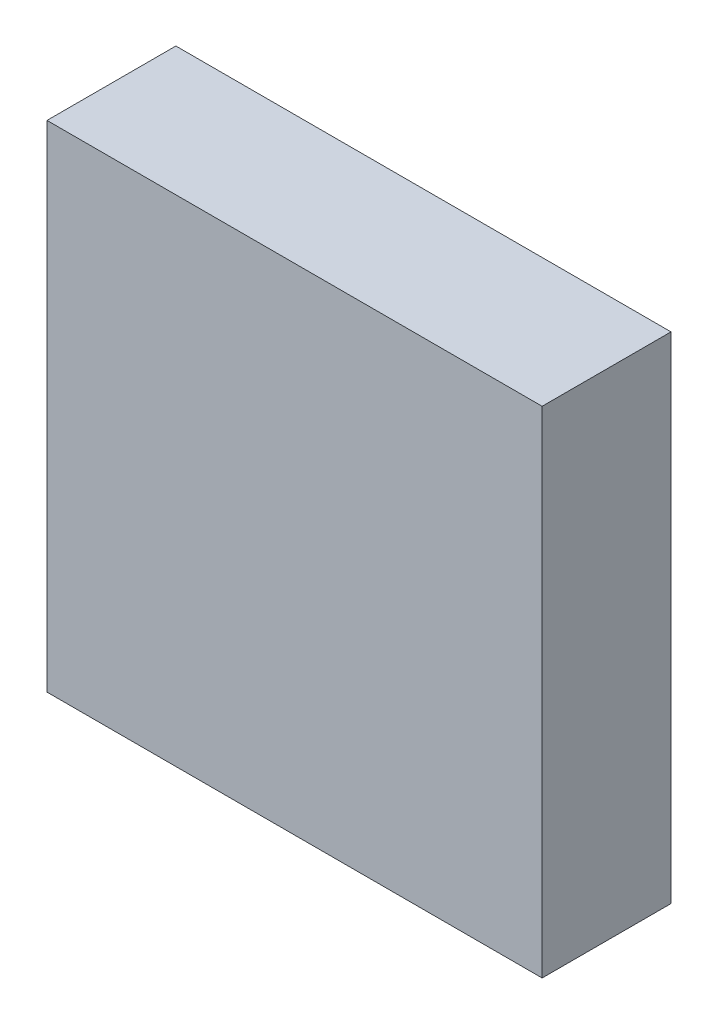
ISO-10303-21;
HEADER;
FILE_DESCRIPTION(('STEP AP214'),'2;1');
FILE_NAME('part.step','',(''),(''),'','','');
FILE_SCHEMA(('AUTOMOTIVE_DESIGN { 1 0 10303 214 1 1 1 1 }'));
ENDSEC;
DATA;
#1=APPLICATION_CONTEXT('core data for automotive mechanical design processes');
#2=APPLICATION_PROTOCOL_DEFINITION('international standard','automotive_design',2000,#1);
#3=PRODUCT_CONTEXT('',#1,'mechanical');
#4=PRODUCT('Part','Part','',(#3));
#5=PRODUCT_RELATED_PRODUCT_CATEGORY('part','',(#4));
#6=PRODUCT_DEFINITION_FORMATION('','',#4);
#7=PRODUCT_DEFINITION_CONTEXT('part definition',#1,'design');
#8=PRODUCT_DEFINITION('design','',#6,#7);
#9=PRODUCT_DEFINITION_SHAPE('','',#8);
#10=(LENGTH_UNIT() NAMED_UNIT(*) SI_UNIT(.MILLI.,.METRE.));
#11=(NAMED_UNIT(*) PLANE_ANGLE_UNIT() SI_UNIT($,.RADIAN.));
#12=(NAMED_UNIT(*) SI_UNIT($,.STERADIAN.) SOLID_ANGLE_UNIT());
#13=UNCERTAINTY_MEASURE_WITH_UNIT(LENGTH_MEASURE(1.E-05),#10,'distance_accuracy_value','');
#14=(GEOMETRIC_REPRESENTATION_CONTEXT(3) GLOBAL_UNCERTAINTY_ASSIGNED_CONTEXT((#13)) GLOBAL_UNIT_ASSIGNED_CONTEXT((#10,
#11,#12)) REPRESENTATION_CONTEXT('',''));
#15=CARTESIAN_POINT('',(0.,0.,0.));
#16=DIRECTION('',(0.,0.,1.));
#17=DIRECTION('',(1.,0.,0.));
#18=AXIS2_PLACEMENT_3D('',#15,#16,#17);
#19=CARTESIAN_POINT('',(-1.82500016,1.82500016,0.95000064));
#20=DIRECTION('',(0.,0.,1.));
#21=DIRECTION('',(1.,0.,0.));
#22=AXIS2_PLACEMENT_3D('',#19,#20,#21);
#23=PLANE('',#22);
#24=DIRECTION('',(0.,1.,0.));
#25=VECTOR('',#24,1.);
#26=CARTESIAN_POINT('',(1.82500016,1.82500016,0.95000064));
#27=LINE('',#26,#25);
#28=CARTESIAN_POINT('',(1.82500016,1.82500016,0.95000064));
#29=VERTEX_POINT('',#28);
#30=CARTESIAN_POINT('',(1.82500016,-1.82500016,0.95000064));
#31=VERTEX_POINT('',#30);
#32=EDGE_CURVE('E52',#29,#31,#27,.F.);
#33=ORIENTED_EDGE('',*,*,#32,.F.);
#34=DIRECTION('',(1.,0.,0.));
#35=VECTOR('',#34,1.);
#36=CARTESIAN_POINT('',(-1.82500016,1.82500016,0.95000064));
#37=LINE('',#36,#35);
#38=CARTESIAN_POINT('',(-1.82500016,1.82500016,0.95000064));
#39=VERTEX_POINT('',#38);
#40=EDGE_CURVE('E67',#39,#29,#37,.T.);
#41=ORIENTED_EDGE('',*,*,#40,.F.);
#42=DIRECTION('',(0.,1.,0.));
#43=VECTOR('',#42,1.);
#44=CARTESIAN_POINT('',(-1.82500016,-1.82500016,0.95000064));
#45=LINE('',#44,#43);
#46=CARTESIAN_POINT('',(-1.82500016,-1.82500016,0.95000064));
#47=VERTEX_POINT('',#46);
#48=EDGE_CURVE('E19',#47,#39,#45,.T.);
#49=ORIENTED_EDGE('',*,*,#48,.F.);
#50=DIRECTION('',(1.,0.,0.));
#51=VECTOR('',#50,1.);
#52=CARTESIAN_POINT('',(1.82500016,-1.82500016,0.95000064));
#53=LINE('',#52,#51);
#54=EDGE_CURVE('E57',#31,#47,#53,.F.);
#55=ORIENTED_EDGE('',*,*,#54,.F.);
#56=EDGE_LOOP('',(#33,#41,#49,#55));
#57=FACE_BOUND('',#56,.T.);
#58=ADVANCED_FACE('F16',(#57),#23,.T.);
#59=CARTESIAN_POINT('',(-1.82500016,-1.82500016,0.));
#60=DIRECTION('',(-1.,0.,0.));
#61=DIRECTION('',(0.,0.,1.));
#62=AXIS2_PLACEMENT_3D('',#59,#60,#61);
#63=PLANE('',#62);
#64=DIRECTION('',(0.,0.,1.));
#65=VECTOR('',#64,1.);
#66=CARTESIAN_POINT('',(-1.82500016,1.82500016,0.));
#67=LINE('',#66,#65);
#68=CARTESIAN_POINT('',(-1.82500016,1.82500016,0.));
#69=VERTEX_POINT('',#68);
#70=EDGE_CURVE('E78',#69,#39,#67,.T.);
#71=ORIENTED_EDGE('',*,*,#70,.F.);
#72=DIRECTION('',(0.,1.,0.));
#73=VECTOR('',#72,1.);
#74=CARTESIAN_POINT('',(-1.82500016,1.82500016,0.));
#75=LINE('',#74,#73);
#76=CARTESIAN_POINT('',(-1.82500016,-1.82500016,0.));
#77=VERTEX_POINT('',#76);
#78=EDGE_CURVE('E73',#69,#77,#75,.F.);
#79=ORIENTED_EDGE('',*,*,#78,.T.);
#80=DIRECTION('',(0.,0.,-1.));
#81=VECTOR('',#80,1.);
#82=CARTESIAN_POINT('',(-1.82500016,-1.82500016,0.));
#83=LINE('',#82,#81);
#84=EDGE_CURVE('E62',#47,#77,#83,.T.);
#85=ORIENTED_EDGE('',*,*,#84,.F.);
#86=ORIENTED_EDGE('',*,*,#48,.T.);
#87=EDGE_LOOP('',(#71,#79,#85,#86));
#88=FACE_BOUND('',#87,.T.);
#89=ADVANCED_FACE('F72',(#88),#63,.T.);
#90=CARTESIAN_POINT('',(1.82500016,-1.82500016,0.));
#91=DIRECTION('',(0.,-1.,0.));
#92=DIRECTION('',(0.,0.,-1.));
#93=AXIS2_PLACEMENT_3D('',#90,#91,#92);
#94=PLANE('',#93);
#95=ORIENTED_EDGE('',*,*,#84,.T.);
#96=DIRECTION('',(1.,0.,0.));
#97=VECTOR('',#96,1.);
#98=CARTESIAN_POINT('',(-1.82500016,-1.82500016,0.));
#99=LINE('',#98,#97);
#100=CARTESIAN_POINT('',(1.82500016,-1.82500016,0.));
#101=VERTEX_POINT('',#100);
#102=EDGE_CURVE('E83',#77,#101,#99,.T.);
#103=ORIENTED_EDGE('',*,*,#102,.T.);
#104=DIRECTION('',(0.,0.,-1.));
#105=VECTOR('',#104,1.);
#106=CARTESIAN_POINT('',(1.82500016,-1.82500016,0.));
#107=LINE('',#106,#105);
#108=EDGE_CURVE('E64',#31,#101,#107,.T.);
#109=ORIENTED_EDGE('',*,*,#108,.F.);
#110=ORIENTED_EDGE('',*,*,#54,.T.);
#111=EDGE_LOOP('',(#95,#103,#109,#110));
#112=FACE_BOUND('',#111,.T.);
#113=ADVANCED_FACE('F59',(#112),#94,.T.);
#114=CARTESIAN_POINT('',(1.82500016,1.82500016,0.));
#115=DIRECTION('',(1.,0.,0.));
#116=DIRECTION('',(0.,0.,-1.));
#117=AXIS2_PLACEMENT_3D('',#114,#115,#116);
#118=PLANE('',#117);
#119=ORIENTED_EDGE('',*,*,#108,.T.);
#120=DIRECTION('',(0.,1.,0.));
#121=VECTOR('',#120,1.);
#122=CARTESIAN_POINT('',(1.82500016,1.82500016,0.));
#123=LINE('',#122,#121);
#124=CARTESIAN_POINT('',(1.82500016,1.82500016,0.));
#125=VERTEX_POINT('',#124);
#126=EDGE_CURVE('E25',#101,#125,#123,.T.);
#127=ORIENTED_EDGE('',*,*,#126,.T.);
#128=DIRECTION('',(0.,0.,1.));
#129=VECTOR('',#128,1.);
#130=CARTESIAN_POINT('',(1.82500016,1.82500016,0.));
#131=LINE('',#130,#129);
#132=EDGE_CURVE('E33',#29,#125,#131,.F.);
#133=ORIENTED_EDGE('',*,*,#132,.F.);
#134=ORIENTED_EDGE('',*,*,#32,.T.);
#135=EDGE_LOOP('',(#119,#127,#133,#134));
#136=FACE_BOUND('',#135,.T.);
#137=ADVANCED_FACE('F87',(#136),#118,.T.);
#138=CARTESIAN_POINT('',(-1.82500016,1.82500016,0.));
#139=DIRECTION('',(0.,1.,0.));
#140=DIRECTION('',(0.,0.,1.));
#141=AXIS2_PLACEMENT_3D('',#138,#139,#140);
#142=PLANE('',#141);
#143=ORIENTED_EDGE('',*,*,#132,.T.);
#144=DIRECTION('',(1.,0.,0.));
#145=VECTOR('',#144,1.);
#146=CARTESIAN_POINT('',(-1.82500016,1.82500016,0.));
#147=LINE('',#146,#145);
#148=EDGE_CURVE('E11',#125,#69,#147,.F.);
#149=ORIENTED_EDGE('',*,*,#148,.T.);
#150=ORIENTED_EDGE('',*,*,#70,.T.);
#151=ORIENTED_EDGE('',*,*,#40,.T.);
#152=EDGE_LOOP('',(#143,#149,#150,#151));
#153=FACE_BOUND('',#152,.T.);
#154=ADVANCED_FACE('F90',(#153),#142,.T.);
#155=CARTESIAN_POINT('',(-1.82500016,1.82500016,0.));
#156=DIRECTION('',(0.,0.,1.));
#157=DIRECTION('',(1.,0.,0.));
#158=AXIS2_PLACEMENT_3D('',#155,#156,#157);
#159=PLANE('',#158);
#160=ORIENTED_EDGE('',*,*,#126,.F.);
#161=ORIENTED_EDGE('',*,*,#102,.F.);
#162=ORIENTED_EDGE('',*,*,#78,.F.);
#163=ORIENTED_EDGE('',*,*,#148,.F.);
#164=EDGE_LOOP('',(#160,#161,#162,#163));
#165=FACE_BOUND('',#164,.T.);
#166=ADVANCED_FACE('F89',(#165),#159,.F.);
#167=CLOSED_SHELL('',(#58,#89,#113,#137,#154,#166));
#168=MANIFOLD_SOLID_BREP('B1',#167);
#169=ADVANCED_BREP_SHAPE_REPRESENTATION('',(#18,#168),#14);
#170=SHAPE_DEFINITION_REPRESENTATION(#9,#169);
ENDSEC;
END-ISO-10303-21;
